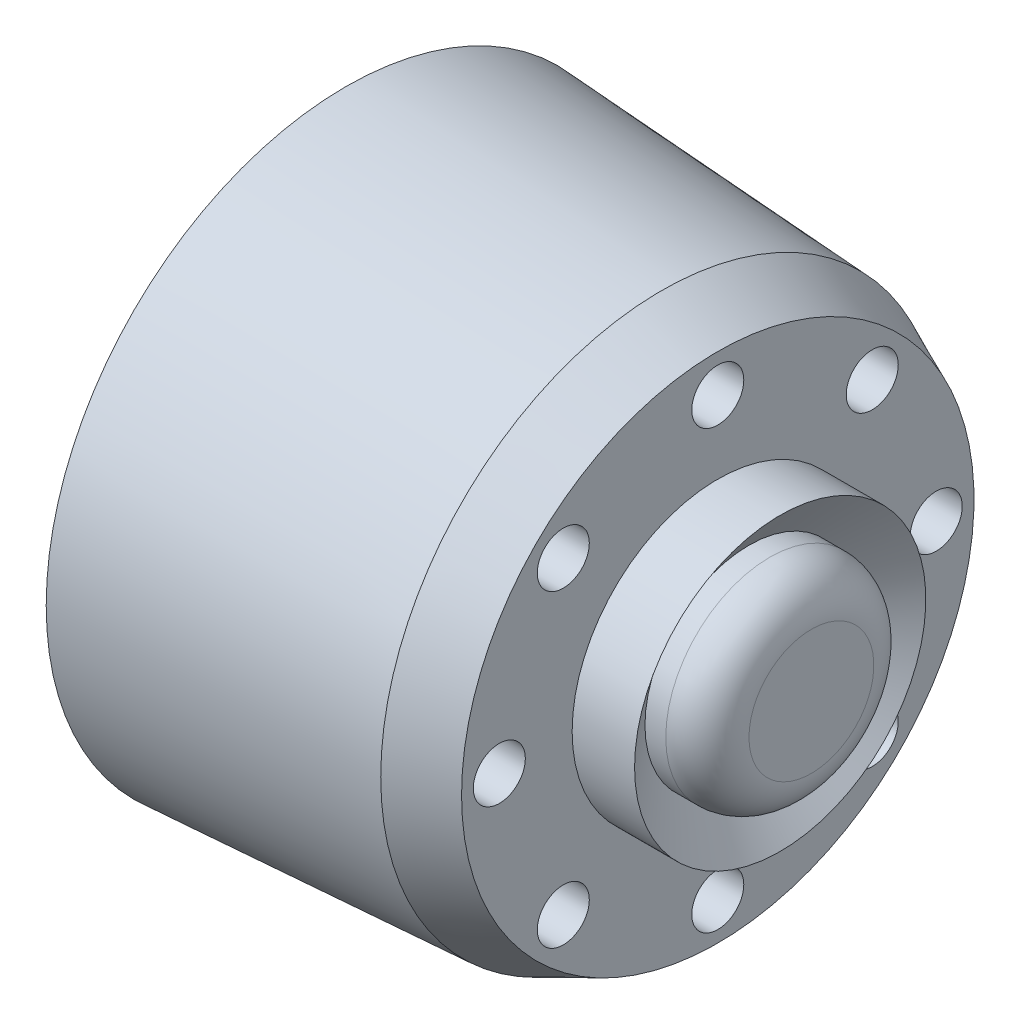
ISO-10303-21;
HEADER;
FILE_DESCRIPTION(('STEP AP214'),'2;1');
FILE_NAME('part.step','',(''),(''),'','','');
FILE_SCHEMA(('AUTOMOTIVE_DESIGN { 1 0 10303 214 1 1 1 1 }'));
ENDSEC;
DATA;
#1=APPLICATION_CONTEXT('core data for automotive mechanical design processes');
#2=APPLICATION_PROTOCOL_DEFINITION('international standard','automotive_design',2000,#1);
#3=PRODUCT_CONTEXT('',#1,'mechanical');
#4=PRODUCT('Part','Part','',(#3));
#5=PRODUCT_RELATED_PRODUCT_CATEGORY('part','',(#4));
#6=PRODUCT_DEFINITION_FORMATION('','',#4);
#7=PRODUCT_DEFINITION_CONTEXT('part definition',#1,'design');
#8=PRODUCT_DEFINITION('design','',#6,#7);
#9=PRODUCT_DEFINITION_SHAPE('','',#8);
#10=(LENGTH_UNIT() NAMED_UNIT(*) SI_UNIT(.MILLI.,.METRE.));
#11=(NAMED_UNIT(*) PLANE_ANGLE_UNIT() SI_UNIT($,.RADIAN.));
#12=(NAMED_UNIT(*) SI_UNIT($,.STERADIAN.) SOLID_ANGLE_UNIT());
#13=UNCERTAINTY_MEASURE_WITH_UNIT(LENGTH_MEASURE(1.E-05),#10,'distance_accuracy_value','');
#14=(GEOMETRIC_REPRESENTATION_CONTEXT(3) GLOBAL_UNCERTAINTY_ASSIGNED_CONTEXT((#13)) GLOBAL_UNIT_ASSIGNED_CONTEXT((#10,
#11,#12)) REPRESENTATION_CONTEXT('',''));
#15=CARTESIAN_POINT('',(0.,0.,0.));
#16=DIRECTION('',(0.,0.,1.));
#17=DIRECTION('',(1.,0.,0.));
#18=AXIS2_PLACEMENT_3D('',#15,#16,#17);
#19=CARTESIAN_POINT('',(-6.18497623585789,7.42462120245855,7.42462120245867));
#20=DIRECTION('',(1.,0.,0.));
#21=DIRECTION('',(0.,0.,-1.));
#22=AXIS2_PLACEMENT_3D('',#19,#20,#21);
#23=CYLINDRICAL_SURFACE('',#22,1.25);
#24=CARTESIAN_POINT('',(11.6938597161833,7.42462120245855,7.42462120245867));
#25=DIRECTION('',(1.,0.,0.));
#26=DIRECTION('',(0.,0.,-1.));
#27=AXIS2_PLACEMENT_3D('',#24,#25,#26);
#28=CIRCLE('',#27,1.25);
#29=CARTESIAN_POINT('',(11.6938597161833,7.42462120245855,6.17462120245867));
#30=VERTEX_POINT('',#29);
#31=EDGE_CURVE('E64',#30,#30,#28,.T.);
#32=ORIENTED_EDGE('',*,*,#31,.T.);
#33=EDGE_LOOP('',(#32));
#34=FACE_BOUND('',#33,.T.);
#35=CARTESIAN_POINT('',(8.69385971618329,7.42462120245855,7.42462120245867));
#36=DIRECTION('',(-1.,0.,0.));
#37=DIRECTION('',(0.,0.,1.));
#38=AXIS2_PLACEMENT_3D('',#35,#36,#37);
#39=CIRCLE('',#38,1.25);
#40=CARTESIAN_POINT('',(8.69385971618329,7.42462120245855,8.67462120245867));
#41=VERTEX_POINT('',#40);
#42=EDGE_CURVE('E60',#41,#41,#39,.F.);
#43=ORIENTED_EDGE('',*,*,#42,.F.);
#44=EDGE_LOOP('',(#43));
#45=FACE_BOUND('',#44,.T.);
#46=ADVANCED_FACE('F39',(#34,#45),#23,.F.);
#47=CARTESIAN_POINT('',(-6.18497623585789,-2.83696619414402E-13,10.4999999999997));
#48=DIRECTION('',(1.,0.,0.));
#49=DIRECTION('',(0.,0.,-1.));
#50=AXIS2_PLACEMENT_3D('',#47,#48,#49);
#51=CYLINDRICAL_SURFACE('',#50,1.25);
#52=CARTESIAN_POINT('',(11.6938597161833,-2.83696619414402E-13,10.4999999999997));
#53=DIRECTION('',(1.,0.,0.));
#54=DIRECTION('',(0.,0.,-1.));
#55=AXIS2_PLACEMENT_3D('',#52,#53,#54);
#56=CIRCLE('',#55,1.25);
#57=CARTESIAN_POINT('',(11.6938597161833,-2.83696619414402E-13,9.24999999999972));
#58=VERTEX_POINT('',#57);
#59=EDGE_CURVE('E125',#58,#58,#56,.T.);
#60=ORIENTED_EDGE('',*,*,#59,.T.);
#61=EDGE_LOOP('',(#60));
#62=FACE_BOUND('',#61,.T.);
#63=CARTESIAN_POINT('',(8.69385971618329,-2.83696619414402E-13,10.4999999999997));
#64=DIRECTION('',(-1.,0.,0.));
#65=DIRECTION('',(0.,0.,1.));
#66=AXIS2_PLACEMENT_3D('',#63,#64,#65);
#67=CIRCLE('',#66,1.25);
#68=CARTESIAN_POINT('',(8.69385971618329,-2.83696619414402E-13,11.7499999999997));
#69=VERTEX_POINT('',#68);
#70=EDGE_CURVE('E65',#69,#69,#67,.F.);
#71=ORIENTED_EDGE('',*,*,#70,.F.);
#72=EDGE_LOOP('',(#71));
#73=FACE_BOUND('',#72,.T.);
#74=ADVANCED_FACE('F270',(#62,#73),#51,.F.);
#75=CARTESIAN_POINT('',(-6.18497623585789,-7.42462120245895,7.42462120245827));
#76=DIRECTION('',(1.,0.,0.));
#77=DIRECTION('',(0.,0.,-1.));
#78=AXIS2_PLACEMENT_3D('',#75,#76,#77);
#79=CYLINDRICAL_SURFACE('',#78,1.25);
#80=CARTESIAN_POINT('',(11.6938597161833,-7.42462120245895,7.42462120245827));
#81=DIRECTION('',(1.,0.,0.));
#82=DIRECTION('',(0.,0.,-1.));
#83=AXIS2_PLACEMENT_3D('',#80,#81,#82);
#84=CIRCLE('',#83,1.25);
#85=CARTESIAN_POINT('',(11.6938597161833,-7.42462120245895,6.17462120245827));
#86=VERTEX_POINT('',#85);
#87=EDGE_CURVE('E129',#86,#86,#84,.T.);
#88=ORIENTED_EDGE('',*,*,#87,.T.);
#89=EDGE_LOOP('',(#88));
#90=FACE_BOUND('',#89,.T.);
#91=CARTESIAN_POINT('',(8.69385971618329,-7.42462120245895,7.42462120245827));
#92=DIRECTION('',(-1.,0.,0.));
#93=DIRECTION('',(0.,0.,1.));
#94=AXIS2_PLACEMENT_3D('',#91,#92,#93);
#95=CIRCLE('',#94,1.25);
#96=CARTESIAN_POINT('',(8.69385971618329,-7.42462120245895,8.67462120245827));
#97=VERTEX_POINT('',#96);
#98=EDGE_CURVE('E69',#97,#97,#95,.F.);
#99=ORIENTED_EDGE('',*,*,#98,.F.);
#100=EDGE_LOOP('',(#99));
#101=FACE_BOUND('',#100,.T.);
#102=ADVANCED_FACE('F276',(#90,#101),#79,.F.);
#103=CARTESIAN_POINT('',(-6.18497623585789,-10.5,-5.64821480550596E-13));
#104=DIRECTION('',(1.,0.,0.));
#105=DIRECTION('',(0.,0.,-1.));
#106=AXIS2_PLACEMENT_3D('',#103,#104,#105);
#107=CYLINDRICAL_SURFACE('',#106,1.25);
#108=CARTESIAN_POINT('',(11.6938597161833,-10.5,-5.64821480550596E-13));
#109=DIRECTION('',(1.,0.,0.));
#110=DIRECTION('',(0.,0.,-1.));
#111=AXIS2_PLACEMENT_3D('',#108,#109,#110);
#112=CIRCLE('',#111,1.25);
#113=CARTESIAN_POINT('',(11.6938597161833,-10.5,-1.25000000000056));
#114=VERTEX_POINT('',#113);
#115=EDGE_CURVE('E133',#114,#114,#112,.T.);
#116=ORIENTED_EDGE('',*,*,#115,.T.);
#117=EDGE_LOOP('',(#116));
#118=FACE_BOUND('',#117,.T.);
#119=CARTESIAN_POINT('',(8.69385971618329,-10.5,-5.64821480550596E-13));
#120=DIRECTION('',(-1.,0.,0.));
#121=DIRECTION('',(0.,0.,1.));
#122=AXIS2_PLACEMENT_3D('',#119,#120,#121);
#123=CIRCLE('',#122,1.25);
#124=CARTESIAN_POINT('',(8.69385971618329,-10.5,1.24999999999944));
#125=VERTEX_POINT('',#124);
#126=EDGE_CURVE('E73',#125,#125,#123,.F.);
#127=ORIENTED_EDGE('',*,*,#126,.F.);
#128=EDGE_LOOP('',(#127));
#129=FACE_BOUND('',#128,.T.);
#130=ADVANCED_FACE('F507',(#118,#129),#107,.F.);
#131=CARTESIAN_POINT('',(-6.18497623585789,-7.42462120245855,-7.42462120245923));
#132=DIRECTION('',(1.,0.,0.));
#133=DIRECTION('',(0.,0.,-1.));
#134=AXIS2_PLACEMENT_3D('',#131,#132,#133);
#135=CYLINDRICAL_SURFACE('',#134,1.25);
#136=CARTESIAN_POINT('',(11.6938597161833,-7.42462120245855,-7.42462120245923));
#137=DIRECTION('',(1.,0.,0.));
#138=DIRECTION('',(0.,0.,-1.));
#139=AXIS2_PLACEMENT_3D('',#136,#137,#138);
#140=CIRCLE('',#139,1.25);
#141=CARTESIAN_POINT('',(11.6938597161833,-7.42462120245855,-8.67462120245923));
#142=VERTEX_POINT('',#141);
#143=EDGE_CURVE('E137',#142,#142,#140,.T.);
#144=ORIENTED_EDGE('',*,*,#143,.T.);
#145=EDGE_LOOP('',(#144));
#146=FACE_BOUND('',#145,.T.);
#147=CARTESIAN_POINT('',(8.69385971618329,-7.42462120245855,-7.42462120245923));
#148=DIRECTION('',(-1.,0.,0.));
#149=DIRECTION('',(0.,0.,1.));
#150=AXIS2_PLACEMENT_3D('',#147,#148,#149);
#151=CIRCLE('',#150,1.25);
#152=CARTESIAN_POINT('',(8.69385971618329,-7.42462120245855,-6.17462120245923));
#153=VERTEX_POINT('',#152);
#154=EDGE_CURVE('E77',#153,#153,#151,.F.);
#155=ORIENTED_EDGE('',*,*,#154,.F.);
#156=EDGE_LOOP('',(#155));
#157=FACE_BOUND('',#156,.T.);
#158=ADVANCED_FACE('F499',(#146,#157),#135,.F.);
#159=CARTESIAN_POINT('',(-6.18497623585789,2.82410740275298E-13,-10.5000000000003));
#160=DIRECTION('',(1.,0.,0.));
#161=DIRECTION('',(0.,0.,-1.));
#162=AXIS2_PLACEMENT_3D('',#159,#160,#161);
#163=CYLINDRICAL_SURFACE('',#162,1.25);
#164=CARTESIAN_POINT('',(11.6938597161833,2.82410740275298E-13,-10.5000000000003));
#165=DIRECTION('',(1.,0.,0.));
#166=DIRECTION('',(0.,0.,-1.));
#167=AXIS2_PLACEMENT_3D('',#164,#165,#166);
#168=CIRCLE('',#167,1.25);
#169=CARTESIAN_POINT('',(11.6938597161833,2.82410740275298E-13,-11.7500000000003));
#170=VERTEX_POINT('',#169);
#171=EDGE_CURVE('E141',#170,#170,#168,.T.);
#172=ORIENTED_EDGE('',*,*,#171,.T.);
#173=EDGE_LOOP('',(#172));
#174=FACE_BOUND('',#173,.T.);
#175=CARTESIAN_POINT('',(8.69385971618329,2.82410740275298E-13,-10.5000000000003));
#176=DIRECTION('',(-1.,0.,0.));
#177=DIRECTION('',(0.,0.,1.));
#178=AXIS2_PLACEMENT_3D('',#175,#176,#177);
#179=CIRCLE('',#178,1.25);
#180=CARTESIAN_POINT('',(8.69385971618329,2.82410740275298E-13,-9.25000000000028));
#181=VERTEX_POINT('',#180);
#182=EDGE_CURVE('E81',#181,#181,#179,.F.);
#183=ORIENTED_EDGE('',*,*,#182,.F.);
#184=EDGE_LOOP('',(#183));
#185=FACE_BOUND('',#184,.T.);
#186=ADVANCED_FACE('F491',(#174,#185),#163,.F.);
#187=CARTESIAN_POINT('',(-6.18497623585789,7.42462120245895,-7.42462120245883));
#188=DIRECTION('',(1.,0.,0.));
#189=DIRECTION('',(0.,0.,-1.));
#190=AXIS2_PLACEMENT_3D('',#187,#188,#189);
#191=CYLINDRICAL_SURFACE('',#190,1.25);
#192=CARTESIAN_POINT('',(11.6938597161833,7.42462120245895,-7.42462120245883));
#193=DIRECTION('',(1.,0.,0.));
#194=DIRECTION('',(0.,0.,-1.));
#195=AXIS2_PLACEMENT_3D('',#192,#193,#194);
#196=CIRCLE('',#195,1.25);
#197=CARTESIAN_POINT('',(11.6938597161833,7.42462120245895,-8.67462120245883));
#198=VERTEX_POINT('',#197);
#199=EDGE_CURVE('E145',#198,#198,#196,.T.);
#200=ORIENTED_EDGE('',*,*,#199,.T.);
#201=EDGE_LOOP('',(#200));
#202=FACE_BOUND('',#201,.T.);
#203=CARTESIAN_POINT('',(8.69385971618329,7.42462120245895,-7.42462120245883));
#204=DIRECTION('',(-1.,0.,0.));
#205=DIRECTION('',(0.,0.,1.));
#206=AXIS2_PLACEMENT_3D('',#203,#204,#205);
#207=CIRCLE('',#206,1.25);
#208=CARTESIAN_POINT('',(8.69385971618329,7.42462120245895,-6.17462120245883));
#209=VERTEX_POINT('',#208);
#210=EDGE_CURVE('E85',#209,#209,#207,.F.);
#211=ORIENTED_EDGE('',*,*,#210,.F.);
#212=EDGE_LOOP('',(#211));
#213=FACE_BOUND('',#212,.T.);
#214=ADVANCED_FACE('F483',(#202,#213),#191,.F.);
#215=CARTESIAN_POINT('',(-6.18497623585789,10.5,0.));
#216=DIRECTION('',(1.,0.,0.));
#217=DIRECTION('',(0.,0.,-1.));
#218=AXIS2_PLACEMENT_3D('',#215,#216,#217);
#219=CYLINDRICAL_SURFACE('',#218,1.25);
#220=CARTESIAN_POINT('',(11.6938597161833,10.5,0.));
#221=DIRECTION('',(1.,0.,0.));
#222=DIRECTION('',(0.,0.,-1.));
#223=AXIS2_PLACEMENT_3D('',#220,#221,#222);
#224=CIRCLE('',#223,1.25);
#225=CARTESIAN_POINT('',(11.6938597161833,10.5,-1.25));
#226=VERTEX_POINT('',#225);
#227=EDGE_CURVE('E121',#226,#226,#224,.T.);
#228=ORIENTED_EDGE('',*,*,#227,.T.);
#229=EDGE_LOOP('',(#228));
#230=FACE_BOUND('',#229,.T.);
#231=CARTESIAN_POINT('',(8.69385971618329,10.5,0.));
#232=DIRECTION('',(-1.,0.,0.));
#233=DIRECTION('',(0.,0.,1.));
#234=AXIS2_PLACEMENT_3D('',#231,#232,#233);
#235=CIRCLE('',#234,1.25);
#236=CARTESIAN_POINT('',(8.69385971618329,10.5,1.25));
#237=VERTEX_POINT('',#236);
#238=EDGE_CURVE('E89',#237,#237,#235,.F.);
#239=ORIENTED_EDGE('',*,*,#238,.F.);
#240=EDGE_LOOP('',(#239));
#241=FACE_BOUND('',#240,.T.);
#242=ADVANCED_FACE('F235',(#230,#241),#219,.F.);
#243=CARTESIAN_POINT('',(8.99385971618328,0.,0.));
#244=DIRECTION('',(-1.,0.,0.));
#245=DIRECTION('',(0.,0.,1.));
#246=AXIS2_PLACEMENT_3D('',#243,#244,#245);
#247=CONICAL_SURFACE('',#246,13.5,0.05922374555614);
#248=CARTESIAN_POINT('',(-6.18497623585789,0.,0.));
#249=DIRECTION('',(-1.,0.,0.));
#250=DIRECTION('',(0.,0.,1.));
#251=AXIS2_PLACEMENT_3D('',#248,#249,#250);
#252=CIRCLE('',#251,14.4);
#253=CARTESIAN_POINT('',(-6.18497623585789,0.,14.4));
#254=VERTEX_POINT('',#253);
#255=EDGE_CURVE('E109',#254,#254,#252,.T.);
#256=ORIENTED_EDGE('',*,*,#255,.F.);
#257=EDGE_LOOP('',(#256));
#258=FACE_BOUND('',#257,.T.);
#259=CARTESIAN_POINT('',(8.99385971618328,0.,0.));
#260=DIRECTION('',(-1.,0.,0.));
#261=DIRECTION('',(0.,0.,1.));
#262=AXIS2_PLACEMENT_3D('',#259,#260,#261);
#263=CIRCLE('',#262,13.5);
#264=CARTESIAN_POINT('',(8.99385971618328,0.,13.5));
#265=VERTEX_POINT('',#264);
#266=EDGE_CURVE('E52',#265,#265,#263,.T.);
#267=ORIENTED_EDGE('',*,*,#266,.T.);
#268=EDGE_LOOP('',(#267));
#269=FACE_BOUND('',#268,.T.);
#270=ADVANCED_FACE('F231',(#258,#269),#247,.T.);
#271=CARTESIAN_POINT('',(11.6938597161833,0.,0.));
#272=DIRECTION('',(-1.,0.,0.));
#273=DIRECTION('',(0.,0.,1.));
#274=AXIS2_PLACEMENT_3D('',#271,#272,#273);
#275=CONICAL_SURFACE('',#274,12.315,0.413575602736293);
#276=ORIENTED_EDGE('',*,*,#266,.F.);
#277=EDGE_LOOP('',(#276));
#278=FACE_BOUND('',#277,.T.);
#279=CARTESIAN_POINT('',(11.6938597161833,0.,0.));
#280=DIRECTION('',(-1.,0.,0.));
#281=DIRECTION('',(0.,0.,1.));
#282=AXIS2_PLACEMENT_3D('',#279,#280,#281);
#283=CIRCLE('',#282,12.315);
#284=CARTESIAN_POINT('',(11.6938597161833,0.,12.315));
#285=VERTEX_POINT('',#284);
#286=EDGE_CURVE('E57',#285,#285,#283,.T.);
#287=ORIENTED_EDGE('',*,*,#286,.T.);
#288=EDGE_LOOP('',(#287));
#289=FACE_BOUND('',#288,.T.);
#290=ADVANCED_FACE('F234',(#278,#289),#275,.T.);
#291=CARTESIAN_POINT('',(11.6938597161833,0.,-12.315));
#292=DIRECTION('',(-1.,0.,0.));
#293=DIRECTION('',(0.,0.,1.));
#294=AXIS2_PLACEMENT_3D('',#291,#292,#293);
#295=PLANE('',#294);
#296=ORIENTED_EDGE('',*,*,#227,.F.);
#297=EDGE_LOOP('',(#296));
#298=FACE_BOUND('',#297,.T.);
#299=ORIENTED_EDGE('',*,*,#199,.F.);
#300=EDGE_LOOP('',(#299));
#301=FACE_BOUND('',#300,.T.);
#302=ORIENTED_EDGE('',*,*,#171,.F.);
#303=EDGE_LOOP('',(#302));
#304=FACE_BOUND('',#303,.T.);
#305=ORIENTED_EDGE('',*,*,#143,.F.);
#306=EDGE_LOOP('',(#305));
#307=FACE_BOUND('',#306,.T.);
#308=ORIENTED_EDGE('',*,*,#115,.F.);
#309=EDGE_LOOP('',(#308));
#310=FACE_BOUND('',#309,.T.);
#311=ORIENTED_EDGE('',*,*,#87,.F.);
#312=EDGE_LOOP('',(#311));
#313=FACE_BOUND('',#312,.T.);
#314=ORIENTED_EDGE('',*,*,#59,.F.);
#315=EDGE_LOOP('',(#314));
#316=FACE_BOUND('',#315,.T.);
#317=ORIENTED_EDGE('',*,*,#31,.F.);
#318=EDGE_LOOP('',(#317));
#319=FACE_BOUND('',#318,.T.);
#320=ORIENTED_EDGE('',*,*,#286,.F.);
#321=EDGE_LOOP('',(#320));
#322=FACE_BOUND('',#321,.T.);
#323=CARTESIAN_POINT('',(11.6938597161833,0.,0.));
#324=DIRECTION('',(-1.,0.,0.));
#325=DIRECTION('',(0.,0.,1.));
#326=AXIS2_PLACEMENT_3D('',#323,#324,#325);
#327=CIRCLE('',#326,7.);
#328=CARTESIAN_POINT('',(11.6938597161833,0.,7.));
#329=VERTEX_POINT('',#328);
#330=EDGE_CURVE('E97',#329,#329,#327,.T.);
#331=ORIENTED_EDGE('',*,*,#330,.T.);
#332=EDGE_LOOP('',(#331));
#333=FACE_BOUND('',#332,.T.);
#334=ADVANCED_FACE('F240',(#298,#301,#304,#307,#310,#313,#316,#319,#322,#333),#295,.F.);
#335=CARTESIAN_POINT('',(-18.2337662337662,0.,0.));
#336=DIRECTION('',(-1.,0.,0.));
#337=DIRECTION('',(0.,0.,1.));
#338=AXIS2_PLACEMENT_3D('',#335,#336,#337);
#339=CYLINDRICAL_SURFACE('',#338,7.);
#340=ORIENTED_EDGE('',*,*,#330,.F.);
#341=EDGE_LOOP('',(#340));
#342=FACE_BOUND('',#341,.T.);
#343=CARTESIAN_POINT('',(14.6938597161833,0.,0.));
#344=DIRECTION('',(-1.,0.,0.));
#345=DIRECTION('',(0.,0.,1.));
#346=AXIS2_PLACEMENT_3D('',#343,#344,#345);
#347=CIRCLE('',#346,7.);
#348=CARTESIAN_POINT('',(14.6938597161833,0.,7.));
#349=VERTEX_POINT('',#348);
#350=EDGE_CURVE('E101',#349,#349,#347,.T.);
#351=ORIENTED_EDGE('',*,*,#350,.T.);
#352=EDGE_LOOP('',(#351));
#353=FACE_BOUND('',#352,.T.);
#354=ADVANCED_FACE('F246',(#342,#353),#339,.T.);
#355=CARTESIAN_POINT('',(13.1938597161833,0.,0.));
#356=DIRECTION('',(1.,0.,0.));
#357=DIRECTION('',(0.,0.,-1.));
#358=AXIS2_PLACEMENT_3D('',#355,#356,#357);
#359=CONICAL_SURFACE('',#358,5.,0.927295218001612);
#360=ORIENTED_EDGE('',*,*,#350,.F.);
#361=EDGE_LOOP('',(#360));
#362=FACE_BOUND('',#361,.T.);
#363=CARTESIAN_POINT('',(13.1938597161833,0.,0.));
#364=DIRECTION('',(-1.,0.,0.));
#365=DIRECTION('',(0.,0.,1.));
#366=AXIS2_PLACEMENT_3D('',#363,#364,#365);
#367=CIRCLE('',#366,5.);
#368=CARTESIAN_POINT('',(13.1938597161833,0.,5.));
#369=VERTEX_POINT('',#368);
#370=EDGE_CURVE('E105',#369,#369,#367,.T.);
#371=ORIENTED_EDGE('',*,*,#370,.T.);
#372=EDGE_LOOP('',(#371));
#373=FACE_BOUND('',#372,.T.);
#374=ADVANCED_FACE('F253',(#362,#373),#359,.F.);
#375=CARTESIAN_POINT('',(-18.2337662337662,0.,0.));
#376=DIRECTION('',(-1.,0.,0.));
#377=DIRECTION('',(0.,0.,1.));
#378=AXIS2_PLACEMENT_3D('',#375,#376,#377);
#379=CYLINDRICAL_SURFACE('',#378,5.);
#380=CARTESIAN_POINT('',(14.1938597161833,0.,0.));
#381=DIRECTION('',(-1.,0.,0.));
#382=DIRECTION('',(0.,0.,1.));
#383=AXIS2_PLACEMENT_3D('',#380,#381,#382);
#384=CIRCLE('',#383,5.);
#385=CARTESIAN_POINT('',(14.1938597161833,0.,5.));
#386=VERTEX_POINT('',#385);
#387=EDGE_CURVE('E47',#386,#386,#384,.T.);
#388=ORIENTED_EDGE('',*,*,#387,.T.);
#389=EDGE_LOOP('',(#388));
#390=FACE_BOUND('',#389,.T.);
#391=ORIENTED_EDGE('',*,*,#370,.F.);
#392=EDGE_LOOP('',(#391));
#393=FACE_BOUND('',#392,.T.);
#394=ADVANCED_FACE('F259',(#390,#393),#379,.T.);
#395=CARTESIAN_POINT('',(16.1938597161833,0.,-5.));
#396=DIRECTION('',(-1.,0.,0.));
#397=DIRECTION('',(0.,0.,1.));
#398=AXIS2_PLACEMENT_3D('',#395,#396,#397);
#399=PLANE('',#398);
#400=CARTESIAN_POINT('',(16.1938597161833,0.,0.));
#401=DIRECTION('',(-1.,0.,0.));
#402=DIRECTION('',(0.,0.,1.));
#403=AXIS2_PLACEMENT_3D('',#400,#401,#402);
#404=CIRCLE('',#403,3.);
#405=CARTESIAN_POINT('',(16.1938597161833,0.,3.));
#406=VERTEX_POINT('',#405);
#407=EDGE_CURVE('E11',#406,#406,#404,.F.);
#408=ORIENTED_EDGE('',*,*,#407,.T.);
#409=EDGE_LOOP('',(#408));
#410=FACE_BOUND('',#409,.T.);
#411=ADVANCED_FACE('F222',(#410),#399,.F.);
#412=CARTESIAN_POINT('',(-6.18497623585789,0.,0.));
#413=DIRECTION('',(1.,0.,0.));
#414=DIRECTION('',(0.,0.,-1.));
#415=AXIS2_PLACEMENT_3D('',#412,#413,#414);
#416=PLANE('',#415);
#417=CARTESIAN_POINT('',(-6.18497623585789,7.42462120245845,-7.42462120245863));
#418=DIRECTION('',(-1.,0.,0.));
#419=DIRECTION('',(0.,0.,1.));
#420=AXIS2_PLACEMENT_3D('',#417,#418,#419);
#421=CIRCLE('',#420,2.5);
#422=CARTESIAN_POINT('',(-6.18497623585789,7.42462120245845,-4.92462120245863));
#423=VERTEX_POINT('',#422);
#424=EDGE_CURVE('E165',#423,#423,#421,.T.);
#425=ORIENTED_EDGE('',*,*,#424,.F.);
#426=EDGE_LOOP('',(#425));
#427=FACE_BOUND('',#426,.T.);
#428=CARTESIAN_POINT('',(-6.18497623585789,-4.25805166566423E-13,-10.4999999999996));
#429=DIRECTION('',(-1.,0.,0.));
#430=DIRECTION('',(0.,0.,1.));
#431=AXIS2_PLACEMENT_3D('',#428,#429,#430);
#432=CIRCLE('',#431,2.5);
#433=CARTESIAN_POINT('',(-6.18497623585789,-4.25805166566423E-13,-7.99999999999958));
#434=VERTEX_POINT('',#433);
#435=EDGE_CURVE('E164',#434,#434,#432,.T.);
#436=ORIENTED_EDGE('',*,*,#435,.F.);
#437=EDGE_LOOP('',(#436));
#438=FACE_BOUND('',#437,.T.);
#439=CARTESIAN_POINT('',(-6.18497623585789,-7.42462120245905,-7.42462120245803));
#440=DIRECTION('',(-1.,0.,0.));
#441=DIRECTION('',(0.,0.,1.));
#442=AXIS2_PLACEMENT_3D('',#439,#440,#441);
#443=CIRCLE('',#442,2.5);
#444=CARTESIAN_POINT('',(-6.18497623585789,-7.42462120245905,-4.92462120245802));
#445=VERTEX_POINT('',#444);
#446=EDGE_CURVE('E173',#445,#445,#443,.T.);
#447=ORIENTED_EDGE('',*,*,#446,.F.);
#448=EDGE_LOOP('',(#447));
#449=FACE_BOUND('',#448,.T.);
#450=CARTESIAN_POINT('',(-6.18497623585789,-10.5,8.49038574854636E-13));
#451=DIRECTION('',(-1.,0.,0.));
#452=DIRECTION('',(0.,0.,1.));
#453=AXIS2_PLACEMENT_3D('',#450,#451,#452);
#454=CIRCLE('',#453,2.5);
#455=CARTESIAN_POINT('',(-6.18497623585789,-10.5,2.50000000000085));
#456=VERTEX_POINT('',#455);
#457=EDGE_CURVE('E181',#456,#456,#454,.T.);
#458=ORIENTED_EDGE('',*,*,#457,.F.);
#459=EDGE_LOOP('',(#458));
#460=FACE_BOUND('',#459,.T.);
#461=CARTESIAN_POINT('',(-6.18497623585789,-7.42462120245845,7.42462120245947));
#462=DIRECTION('',(-1.,0.,0.));
#463=DIRECTION('',(0.,0.,1.));
#464=AXIS2_PLACEMENT_3D('',#461,#462,#463);
#465=CIRCLE('',#464,2.5);
#466=CARTESIAN_POINT('',(-6.18497623585789,-7.42462120245845,9.92462120245948));
#467=VERTEX_POINT('',#466);
#468=EDGE_CURVE('E189',#467,#467,#465,.T.);
#469=ORIENTED_EDGE('',*,*,#468,.F.);
#470=EDGE_LOOP('',(#469));
#471=FACE_BOUND('',#470,.T.);
#472=CARTESIAN_POINT('',(-6.18497623585789,4.24519287427318E-13,10.5000000000004));
#473=DIRECTION('',(-1.,0.,0.));
#474=DIRECTION('',(0.,0.,1.));
#475=AXIS2_PLACEMENT_3D('',#472,#473,#474);
#476=CIRCLE('',#475,2.5);
#477=CARTESIAN_POINT('',(-6.18497623585789,4.24519287427318E-13,13.0000000000004));
#478=VERTEX_POINT('',#477);
#479=EDGE_CURVE('E197',#478,#478,#476,.T.);
#480=ORIENTED_EDGE('',*,*,#479,.F.);
#481=EDGE_LOOP('',(#480));
#482=FACE_BOUND('',#481,.T.);
#483=CARTESIAN_POINT('',(-6.18497623585789,7.42462120245905,7.42462120245887));
#484=DIRECTION('',(-1.,0.,0.));
#485=DIRECTION('',(0.,0.,1.));
#486=AXIS2_PLACEMENT_3D('',#483,#484,#485);
#487=CIRCLE('',#486,2.50000000000005);
#488=CARTESIAN_POINT('',(-6.18497623585789,7.42462120245905,9.92462120245892));
#489=VERTEX_POINT('',#488);
#490=EDGE_CURVE('E205',#489,#489,#487,.T.);
#491=ORIENTED_EDGE('',*,*,#490,.F.);
#492=EDGE_LOOP('',(#491));
#493=FACE_BOUND('',#492,.T.);
#494=CARTESIAN_POINT('',(-6.18497623585789,10.5,0.));
#495=DIRECTION('',(-1.,0.,0.));
#496=DIRECTION('',(0.,0.,1.));
#497=AXIS2_PLACEMENT_3D('',#494,#495,#496);
#498=CIRCLE('',#497,2.5);
#499=CARTESIAN_POINT('',(-6.18497623585789,10.5,2.5));
#500=VERTEX_POINT('',#499);
#501=EDGE_CURVE('E155',#500,#500,#498,.T.);
#502=ORIENTED_EDGE('',*,*,#501,.F.);
#503=EDGE_LOOP('',(#502));
#504=FACE_BOUND('',#503,.T.);
#505=CARTESIAN_POINT('',(-6.18497623585789,0.,0.));
#506=DIRECTION('',(-1.,0.,0.));
#507=DIRECTION('',(0.,0.,1.));
#508=AXIS2_PLACEMENT_3D('',#505,#506,#507);
#509=CIRCLE('',#508,4.725);
#510=CARTESIAN_POINT('',(-6.18497623585789,0.,4.725));
#511=VERTEX_POINT('',#510);
#512=EDGE_CURVE('E117',#511,#511,#509,.T.);
#513=ORIENTED_EDGE('',*,*,#512,.F.);
#514=EDGE_LOOP('',(#513));
#515=FACE_BOUND('',#514,.T.);
#516=ORIENTED_EDGE('',*,*,#255,.T.);
#517=EDGE_LOOP('',(#516));
#518=FACE_BOUND('',#517,.T.);
#519=ADVANCED_FACE('F218',(#427,#438,#449,#460,#471,#482,#493,#504,#515,#518),#416,.F.);
#520=CARTESIAN_POINT('',(0.815023764142113,0.,0.));
#521=DIRECTION('',(1.,0.,0.));
#522=DIRECTION('',(0.,0.,-1.));
#523=AXIS2_PLACEMENT_3D('',#520,#521,#522);
#524=PLANE('',#523);
#525=CARTESIAN_POINT('',(0.815023764142112,0.,0.));
#526=DIRECTION('',(1.,0.,0.));
#527=DIRECTION('',(0.,0.,-1.));
#528=AXIS2_PLACEMENT_3D('',#525,#526,#527);
#529=CIRCLE('',#528,4.725);
#530=CARTESIAN_POINT('',(0.815023764142112,0.,-4.725));
#531=VERTEX_POINT('',#530);
#532=EDGE_CURVE('E113',#531,#531,#529,.F.);
#533=ORIENTED_EDGE('',*,*,#532,.T.);
#534=EDGE_LOOP('',(#533));
#535=FACE_BOUND('',#534,.T.);
#536=ADVANCED_FACE('F221',(#535),#524,.F.);
#537=CARTESIAN_POINT('',(21.1793419285679,0.,0.));
#538=DIRECTION('',(-1.,0.,0.));
#539=DIRECTION('',(0.,0.,1.));
#540=AXIS2_PLACEMENT_3D('',#537,#538,#539);
#541=CYLINDRICAL_SURFACE('',#540,4.725);
#542=ORIENTED_EDGE('',*,*,#512,.T.);
#543=EDGE_LOOP('',(#542));
#544=FACE_BOUND('',#543,.T.);
#545=ORIENTED_EDGE('',*,*,#532,.F.);
#546=EDGE_LOOP('',(#545));
#547=FACE_BOUND('',#546,.T.);
#548=ADVANCED_FACE('F282',(#544,#547),#541,.F.);
#549=CARTESIAN_POINT('',(8.69385971618329,0.,-12.315));
#550=DIRECTION('',(-1.,0.,0.));
#551=DIRECTION('',(0.,0.,1.));
#552=AXIS2_PLACEMENT_3D('',#549,#550,#551);
#553=PLANE('',#552);
#554=CARTESIAN_POINT('',(8.69385971618329,10.5,0.));
#555=DIRECTION('',(-1.,0.,0.));
#556=DIRECTION('',(0.,0.,1.));
#557=AXIS2_PLACEMENT_3D('',#554,#555,#556);
#558=CIRCLE('',#557,2.5);
#559=CARTESIAN_POINT('',(8.69385971618329,10.5,2.5));
#560=VERTEX_POINT('',#559);
#561=EDGE_CURVE('E92',#560,#560,#558,.F.);
#562=ORIENTED_EDGE('',*,*,#561,.F.);
#563=EDGE_LOOP('',(#562));
#564=FACE_BOUND('',#563,.T.);
#565=ORIENTED_EDGE('',*,*,#238,.T.);
#566=EDGE_LOOP('',(#565));
#567=FACE_BOUND('',#566,.T.);
#568=ADVANCED_FACE('F285',(#564,#567),#553,.T.);
#569=CARTESIAN_POINT('',(18.7649275280489,10.5,0.));
#570=DIRECTION('',(-1.,0.,0.));
#571=DIRECTION('',(0.,0.,1.));
#572=AXIS2_PLACEMENT_3D('',#569,#570,#571);
#573=CYLINDRICAL_SURFACE('',#572,2.5);
#574=ORIENTED_EDGE('',*,*,#561,.T.);
#575=EDGE_LOOP('',(#574));
#576=FACE_BOUND('',#575,.T.);
#577=ORIENTED_EDGE('',*,*,#501,.T.);
#578=EDGE_LOOP('',(#577));
#579=FACE_BOUND('',#578,.T.);
#580=ADVANCED_FACE('F307',(#576,#579),#573,.F.);
#581=CARTESIAN_POINT('',(8.69385971618329,0.,-12.315));
#582=DIRECTION('',(-1.,0.,0.));
#583=DIRECTION('',(0.,0.,1.));
#584=AXIS2_PLACEMENT_3D('',#581,#582,#583);
#585=PLANE('',#584);
#586=CARTESIAN_POINT('',(8.69385971618329,7.42462120245845,-7.42462120245863));
#587=DIRECTION('',(-1.,0.,0.));
#588=DIRECTION('',(0.,0.,1.));
#589=AXIS2_PLACEMENT_3D('',#586,#587,#588);
#590=CIRCLE('',#589,2.5);
#591=CARTESIAN_POINT('',(8.69385971618329,7.42462120245845,-4.92462120245863));
#592=VERTEX_POINT('',#591);
#593=EDGE_CURVE('E160',#592,#592,#590,.F.);
#594=ORIENTED_EDGE('',*,*,#593,.F.);
#595=EDGE_LOOP('',(#594));
#596=FACE_BOUND('',#595,.T.);
#597=ORIENTED_EDGE('',*,*,#210,.T.);
#598=EDGE_LOOP('',(#597));
#599=FACE_BOUND('',#598,.T.);
#600=ADVANCED_FACE('F315',(#596,#599),#585,.T.);
#601=CARTESIAN_POINT('',(18.7649275280489,7.42462120245845,-7.42462120245863));
#602=DIRECTION('',(-1.,0.,0.));
#603=DIRECTION('',(0.,0.,1.));
#604=AXIS2_PLACEMENT_3D('',#601,#602,#603);
#605=CYLINDRICAL_SURFACE('',#604,2.5);
#606=ORIENTED_EDGE('',*,*,#593,.T.);
#607=EDGE_LOOP('',(#606));
#608=FACE_BOUND('',#607,.T.);
#609=ORIENTED_EDGE('',*,*,#424,.T.);
#610=EDGE_LOOP('',(#609));
#611=FACE_BOUND('',#610,.T.);
#612=ADVANCED_FACE('F323',(#608,#611),#605,.F.);
#613=CARTESIAN_POINT('',(8.69385971618329,0.,-12.315));
#614=DIRECTION('',(-1.,0.,0.));
#615=DIRECTION('',(0.,0.,1.));
#616=AXIS2_PLACEMENT_3D('',#613,#614,#615);
#617=PLANE('',#616);
#618=CARTESIAN_POINT('',(8.69385971618329,-4.25805166566423E-13,-10.4999999999996));
#619=DIRECTION('',(-1.,0.,0.));
#620=DIRECTION('',(0.,0.,1.));
#621=AXIS2_PLACEMENT_3D('',#618,#619,#620);
#622=CIRCLE('',#621,2.5);
#623=CARTESIAN_POINT('',(8.69385971618329,-4.25805166566423E-13,-7.99999999999958));
#624=VERTEX_POINT('',#623);
#625=EDGE_CURVE('E169',#624,#624,#622,.F.);
#626=ORIENTED_EDGE('',*,*,#625,.F.);
#627=EDGE_LOOP('',(#626));
#628=FACE_BOUND('',#627,.T.);
#629=ORIENTED_EDGE('',*,*,#182,.T.);
#630=EDGE_LOOP('',(#629));
#631=FACE_BOUND('',#630,.T.);
#632=ADVANCED_FACE('F331',(#628,#631),#617,.T.);
#633=CARTESIAN_POINT('',(18.7649275280489,-4.25805166566423E-13,-10.4999999999996));
#634=DIRECTION('',(-1.,0.,0.));
#635=DIRECTION('',(0.,0.,1.));
#636=AXIS2_PLACEMENT_3D('',#633,#634,#635);
#637=CYLINDRICAL_SURFACE('',#636,2.5);
#638=ORIENTED_EDGE('',*,*,#625,.T.);
#639=EDGE_LOOP('',(#638));
#640=FACE_BOUND('',#639,.T.);
#641=ORIENTED_EDGE('',*,*,#435,.T.);
#642=EDGE_LOOP('',(#641));
#643=FACE_BOUND('',#642,.T.);
#644=ADVANCED_FACE('F339',(#640,#643),#637,.F.);
#645=CARTESIAN_POINT('',(8.69385971618329,0.,-12.315));
#646=DIRECTION('',(-1.,0.,0.));
#647=DIRECTION('',(0.,0.,1.));
#648=AXIS2_PLACEMENT_3D('',#645,#646,#647);
#649=PLANE('',#648);
#650=CARTESIAN_POINT('',(8.69385971618329,-7.42462120245905,-7.42462120245803));
#651=DIRECTION('',(-1.,0.,0.));
#652=DIRECTION('',(0.,0.,1.));
#653=AXIS2_PLACEMENT_3D('',#650,#651,#652);
#654=CIRCLE('',#653,2.5);
#655=CARTESIAN_POINT('',(8.69385971618329,-7.42462120245905,-4.92462120245802));
#656=VERTEX_POINT('',#655);
#657=EDGE_CURVE('E177',#656,#656,#654,.F.);
#658=ORIENTED_EDGE('',*,*,#657,.F.);
#659=EDGE_LOOP('',(#658));
#660=FACE_BOUND('',#659,.T.);
#661=ORIENTED_EDGE('',*,*,#154,.T.);
#662=EDGE_LOOP('',(#661));
#663=FACE_BOUND('',#662,.T.);
#664=ADVANCED_FACE('F347',(#660,#663),#649,.T.);
#665=CARTESIAN_POINT('',(18.7649275280489,-7.42462120245905,-7.42462120245803));
#666=DIRECTION('',(-1.,0.,0.));
#667=DIRECTION('',(0.,0.,1.));
#668=AXIS2_PLACEMENT_3D('',#665,#666,#667);
#669=CYLINDRICAL_SURFACE('',#668,2.5);
#670=ORIENTED_EDGE('',*,*,#657,.T.);
#671=EDGE_LOOP('',(#670));
#672=FACE_BOUND('',#671,.T.);
#673=ORIENTED_EDGE('',*,*,#446,.T.);
#674=EDGE_LOOP('',(#673));
#675=FACE_BOUND('',#674,.T.);
#676=ADVANCED_FACE('F355',(#672,#675),#669,.F.);
#677=CARTESIAN_POINT('',(8.69385971618329,0.,-12.315));
#678=DIRECTION('',(-1.,0.,0.));
#679=DIRECTION('',(0.,0.,1.));
#680=AXIS2_PLACEMENT_3D('',#677,#678,#679);
#681=PLANE('',#680);
#682=CARTESIAN_POINT('',(8.69385971618329,-10.5,8.49038574854636E-13));
#683=DIRECTION('',(-1.,0.,0.));
#684=DIRECTION('',(0.,0.,1.));
#685=AXIS2_PLACEMENT_3D('',#682,#683,#684);
#686=CIRCLE('',#685,2.5);
#687=CARTESIAN_POINT('',(8.69385971618329,-10.5,2.50000000000085));
#688=VERTEX_POINT('',#687);
#689=EDGE_CURVE('E185',#688,#688,#686,.F.);
#690=ORIENTED_EDGE('',*,*,#689,.F.);
#691=EDGE_LOOP('',(#690));
#692=FACE_BOUND('',#691,.T.);
#693=ORIENTED_EDGE('',*,*,#126,.T.);
#694=EDGE_LOOP('',(#693));
#695=FACE_BOUND('',#694,.T.);
#696=ADVANCED_FACE('F363',(#692,#695),#681,.T.);
#697=CARTESIAN_POINT('',(18.7649275280489,-10.5,8.49038574854636E-13));
#698=DIRECTION('',(-1.,0.,0.));
#699=DIRECTION('',(0.,0.,1.));
#700=AXIS2_PLACEMENT_3D('',#697,#698,#699);
#701=CYLINDRICAL_SURFACE('',#700,2.5);
#702=ORIENTED_EDGE('',*,*,#689,.T.);
#703=EDGE_LOOP('',(#702));
#704=FACE_BOUND('',#703,.T.);
#705=ORIENTED_EDGE('',*,*,#457,.T.);
#706=EDGE_LOOP('',(#705));
#707=FACE_BOUND('',#706,.T.);
#708=ADVANCED_FACE('F371',(#704,#707),#701,.F.);
#709=CARTESIAN_POINT('',(8.69385971618329,0.,-12.315));
#710=DIRECTION('',(-1.,0.,0.));
#711=DIRECTION('',(0.,0.,1.));
#712=AXIS2_PLACEMENT_3D('',#709,#710,#711);
#713=PLANE('',#712);
#714=CARTESIAN_POINT('',(8.69385971618329,-7.42462120245845,7.42462120245947));
#715=DIRECTION('',(-1.,0.,0.));
#716=DIRECTION('',(0.,0.,1.));
#717=AXIS2_PLACEMENT_3D('',#714,#715,#716);
#718=CIRCLE('',#717,2.5);
#719=CARTESIAN_POINT('',(8.69385971618329,-7.42462120245845,9.92462120245948));
#720=VERTEX_POINT('',#719);
#721=EDGE_CURVE('E193',#720,#720,#718,.F.);
#722=ORIENTED_EDGE('',*,*,#721,.F.);
#723=EDGE_LOOP('',(#722));
#724=FACE_BOUND('',#723,.T.);
#725=ORIENTED_EDGE('',*,*,#98,.T.);
#726=EDGE_LOOP('',(#725));
#727=FACE_BOUND('',#726,.T.);
#728=ADVANCED_FACE('F379',(#724,#727),#713,.T.);
#729=CARTESIAN_POINT('',(18.7649275280489,-7.42462120245845,7.42462120245947));
#730=DIRECTION('',(-1.,0.,0.));
#731=DIRECTION('',(0.,0.,1.));
#732=AXIS2_PLACEMENT_3D('',#729,#730,#731);
#733=CYLINDRICAL_SURFACE('',#732,2.5);
#734=ORIENTED_EDGE('',*,*,#721,.T.);
#735=EDGE_LOOP('',(#734));
#736=FACE_BOUND('',#735,.T.);
#737=ORIENTED_EDGE('',*,*,#468,.T.);
#738=EDGE_LOOP('',(#737));
#739=FACE_BOUND('',#738,.T.);
#740=ADVANCED_FACE('F387',(#736,#739),#733,.F.);
#741=CARTESIAN_POINT('',(8.69385971618329,0.,-12.315));
#742=DIRECTION('',(-1.,0.,0.));
#743=DIRECTION('',(0.,0.,1.));
#744=AXIS2_PLACEMENT_3D('',#741,#742,#743);
#745=PLANE('',#744);
#746=CARTESIAN_POINT('',(8.69385971618329,4.24519287427318E-13,10.5000000000004));
#747=DIRECTION('',(-1.,0.,0.));
#748=DIRECTION('',(0.,0.,1.));
#749=AXIS2_PLACEMENT_3D('',#746,#747,#748);
#750=CIRCLE('',#749,2.5);
#751=CARTESIAN_POINT('',(8.69385971618329,4.24519287427318E-13,13.0000000000004));
#752=VERTEX_POINT('',#751);
#753=EDGE_CURVE('E201',#752,#752,#750,.F.);
#754=ORIENTED_EDGE('',*,*,#753,.F.);
#755=EDGE_LOOP('',(#754));
#756=FACE_BOUND('',#755,.T.);
#757=ORIENTED_EDGE('',*,*,#70,.T.);
#758=EDGE_LOOP('',(#757));
#759=FACE_BOUND('',#758,.T.);
#760=ADVANCED_FACE('F395',(#756,#759),#745,.T.);
#761=CARTESIAN_POINT('',(18.7649275280489,4.24519287427318E-13,10.5000000000004));
#762=DIRECTION('',(-1.,0.,0.));
#763=DIRECTION('',(0.,0.,1.));
#764=AXIS2_PLACEMENT_3D('',#761,#762,#763);
#765=CYLINDRICAL_SURFACE('',#764,2.5);
#766=ORIENTED_EDGE('',*,*,#753,.T.);
#767=EDGE_LOOP('',(#766));
#768=FACE_BOUND('',#767,.T.);
#769=ORIENTED_EDGE('',*,*,#479,.T.);
#770=EDGE_LOOP('',(#769));
#771=FACE_BOUND('',#770,.T.);
#772=ADVANCED_FACE('F403',(#768,#771),#765,.F.);
#773=CARTESIAN_POINT('',(8.69385971618329,0.,-12.315));
#774=DIRECTION('',(-1.,0.,0.));
#775=DIRECTION('',(0.,0.,1.));
#776=AXIS2_PLACEMENT_3D('',#773,#774,#775);
#777=PLANE('',#776);
#778=CARTESIAN_POINT('',(8.69385971618329,7.42462120245905,7.42462120245887));
#779=DIRECTION('',(-1.,0.,0.));
#780=DIRECTION('',(0.,0.,1.));
#781=AXIS2_PLACEMENT_3D('',#778,#779,#780);
#782=CIRCLE('',#781,2.50000000000005);
#783=CARTESIAN_POINT('',(8.69385971618329,7.42462120245905,9.92462120245892));
#784=VERTEX_POINT('',#783);
#785=EDGE_CURVE('E159',#784,#784,#782,.F.);
#786=ORIENTED_EDGE('',*,*,#785,.F.);
#787=EDGE_LOOP('',(#786));
#788=FACE_BOUND('',#787,.T.);
#789=ORIENTED_EDGE('',*,*,#42,.T.);
#790=EDGE_LOOP('',(#789));
#791=FACE_BOUND('',#790,.T.);
#792=ADVANCED_FACE('F411',(#788,#791),#777,.T.);
#793=CARTESIAN_POINT('',(18.7649275280489,7.42462120245905,7.42462120245887));
#794=DIRECTION('',(-1.,0.,0.));
#795=DIRECTION('',(0.,0.,1.));
#796=AXIS2_PLACEMENT_3D('',#793,#794,#795);
#797=CYLINDRICAL_SURFACE('',#796,2.50000000000005);
#798=ORIENTED_EDGE('',*,*,#785,.T.);
#799=EDGE_LOOP('',(#798));
#800=FACE_BOUND('',#799,.T.);
#801=ORIENTED_EDGE('',*,*,#490,.T.);
#802=EDGE_LOOP('',(#801));
#803=FACE_BOUND('',#802,.T.);
#804=ADVANCED_FACE('F216',(#800,#803),#797,.F.);
#805=CARTESIAN_POINT('',(14.1938597161833,0.,0.));
#806=DIRECTION('',(-1.,0.,0.));
#807=DIRECTION('',(0.,0.,1.));
#808=AXIS2_PLACEMENT_3D('',#805,#806,#807);
#809=TOROIDAL_SURFACE('',#808,3.,2.);
#810=ORIENTED_EDGE('',*,*,#407,.F.);
#811=EDGE_LOOP('',(#810));
#812=FACE_BOUND('',#811,.T.);
#813=ORIENTED_EDGE('',*,*,#387,.F.);
#814=EDGE_LOOP('',(#813));
#815=FACE_BOUND('',#814,.T.);
#816=ADVANCED_FACE('F41',(#812,#815),#809,.T.);
#817=CLOSED_SHELL('',(#46,#74,#102,#130,#158,#186,#214,#242,#270,#290,#334,#354,#374,#394,#411,
#519,#536,#548,#568,#580,#600,#612,#632,#644,#664,#676,#696,#708,#728,#740,#760,#772,#792,#804,#816));
#818=MANIFOLD_SOLID_BREP('B2',#817);
#819=ADVANCED_BREP_SHAPE_REPRESENTATION('',(#18,#818),#14);
#820=SHAPE_DEFINITION_REPRESENTATION(#9,#819);
ENDSEC;
END-ISO-10303-21;
